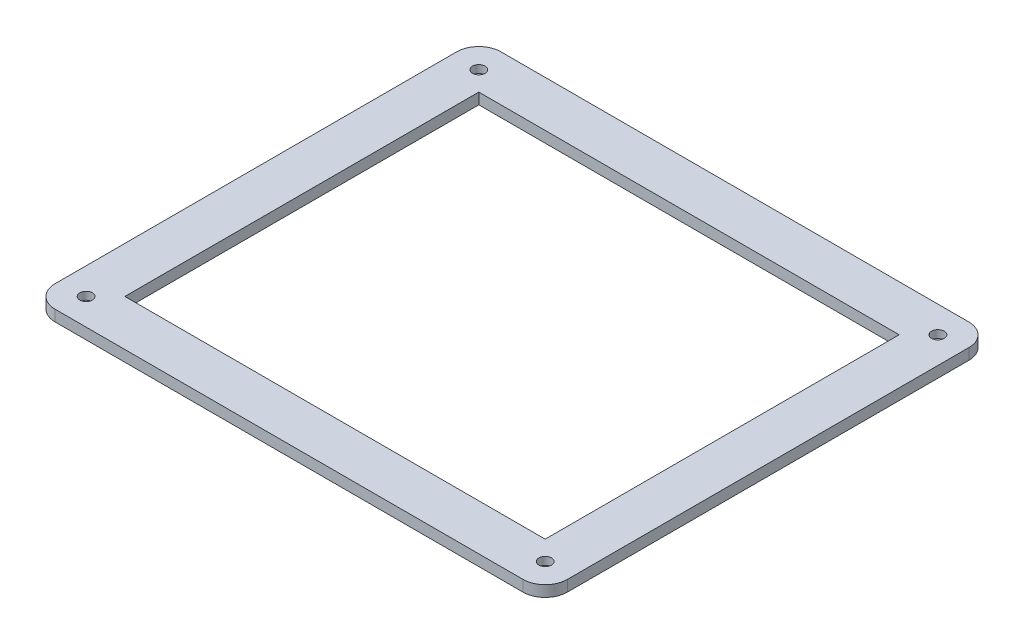
ISO-10303-21;
HEADER;
FILE_DESCRIPTION(('STEP AP214'),'2;1');
FILE_NAME('part.step','',(''),(''),'','','');
FILE_SCHEMA(('AUTOMOTIVE_DESIGN { 1 0 10303 214 1 1 1 1 }'));
ENDSEC;
DATA;
#1=APPLICATION_CONTEXT('core data for automotive mechanical design processes');
#2=APPLICATION_PROTOCOL_DEFINITION('international standard','automotive_design',2000,#1);
#3=PRODUCT_CONTEXT('',#1,'mechanical');
#4=PRODUCT('Part','Part','',(#3));
#5=PRODUCT_RELATED_PRODUCT_CATEGORY('part','',(#4));
#6=PRODUCT_DEFINITION_FORMATION('','',#4);
#7=PRODUCT_DEFINITION_CONTEXT('part definition',#1,'design');
#8=PRODUCT_DEFINITION('design','',#6,#7);
#9=PRODUCT_DEFINITION_SHAPE('','',#8);
#10=(LENGTH_UNIT() NAMED_UNIT(*) SI_UNIT(.MILLI.,.METRE.));
#11=(NAMED_UNIT(*) PLANE_ANGLE_UNIT() SI_UNIT($,.RADIAN.));
#12=(NAMED_UNIT(*) SI_UNIT($,.STERADIAN.) SOLID_ANGLE_UNIT());
#13=UNCERTAINTY_MEASURE_WITH_UNIT(LENGTH_MEASURE(1.E-05),#10,'distance_accuracy_value','');
#14=(GEOMETRIC_REPRESENTATION_CONTEXT(3) GLOBAL_UNCERTAINTY_ASSIGNED_CONTEXT((#13)) GLOBAL_UNIT_ASSIGNED_CONTEXT((#10,
#11,#12)) REPRESENTATION_CONTEXT('',''));
#15=CARTESIAN_POINT('',(0.,0.,0.));
#16=DIRECTION('',(0.,0.,1.));
#17=DIRECTION('',(1.,0.,0.));
#18=AXIS2_PLACEMENT_3D('',#15,#16,#17);
#19=CARTESIAN_POINT('',(-103.7,-2.5,-88.7));
#20=DIRECTION('',(0.,1.,0.));
#21=DIRECTION('',(0.,0.,1.));
#22=AXIS2_PLACEMENT_3D('',#19,#20,#21);
#23=CYLINDRICAL_SURFACE('',#22,1.54999999999999);
#24=CARTESIAN_POINT('',(-103.7,-2.5,-88.7));
#25=DIRECTION('',(0.,-1.,0.));
#26=DIRECTION('',(0.,0.,-1.));
#27=AXIS2_PLACEMENT_3D('',#24,#25,#26);
#28=CIRCLE('',#27,1.54999999999999);
#29=CARTESIAN_POINT('',(-103.7,-2.5,-90.25));
#30=VERTEX_POINT('',#29);
#31=EDGE_CURVE('E656',#30,#30,#28,.T.);
#32=ORIENTED_EDGE('',*,*,#31,.T.);
#33=EDGE_LOOP('',(#32));
#34=FACE_BOUND('',#33,.T.);
#35=CARTESIAN_POINT('',(-103.7,1.5,-88.7));
#36=DIRECTION('',(0.,1.,0.));
#37=DIRECTION('',(0.,0.,1.));
#38=AXIS2_PLACEMENT_3D('',#35,#36,#37);
#39=CIRCLE('',#38,1.54999999999999);
#40=CARTESIAN_POINT('',(-103.7,1.5,-87.15));
#41=VERTEX_POINT('',#40);
#42=EDGE_CURVE('E40',#41,#41,#39,.T.);
#43=ORIENTED_EDGE('',*,*,#42,.T.);
#44=EDGE_LOOP('',(#43));
#45=FACE_BOUND('',#44,.T.);
#46=ADVANCED_FACE('F36',(#34,#45),#23,.F.);
#47=CARTESIAN_POINT('',(103.7,-2.5,-88.7));
#48=DIRECTION('',(0.,1.,0.));
#49=DIRECTION('',(0.,0.,1.));
#50=AXIS2_PLACEMENT_3D('',#47,#48,#49);
#51=CYLINDRICAL_SURFACE('',#50,1.54999999999999);
#52=CARTESIAN_POINT('',(103.7,-2.5,-88.7));
#53=DIRECTION('',(0.,1.,0.));
#54=DIRECTION('',(0.,0.,-1.));
#55=AXIS2_PLACEMENT_3D('',#52,#53,#54);
#56=CIRCLE('',#55,1.54999999999999);
#57=CARTESIAN_POINT('',(103.7,-2.5,-90.25));
#58=VERTEX_POINT('',#57);
#59=EDGE_CURVE('E241',#58,#58,#56,.T.);
#60=ORIENTED_EDGE('',*,*,#59,.F.);
#61=EDGE_LOOP('',(#60));
#62=FACE_BOUND('',#61,.T.);
#63=CARTESIAN_POINT('',(103.7,1.5,-88.7));
#64=DIRECTION('',(0.,1.,0.));
#65=DIRECTION('',(0.,0.,1.));
#66=AXIS2_PLACEMENT_3D('',#63,#64,#65);
#67=CIRCLE('',#66,1.54999999999999);
#68=CARTESIAN_POINT('',(103.7,1.5,-87.15));
#69=VERTEX_POINT('',#68);
#70=EDGE_CURVE('E239',#69,#69,#67,.F.);
#71=ORIENTED_EDGE('',*,*,#70,.F.);
#72=EDGE_LOOP('',(#71));
#73=FACE_BOUND('',#72,.T.);
#74=ADVANCED_FACE('F316',(#62,#73),#51,.F.);
#75=CARTESIAN_POINT('',(103.7,-2.5,88.7));
#76=DIRECTION('',(0.,1.,0.));
#77=DIRECTION('',(0.,0.,1.));
#78=AXIS2_PLACEMENT_3D('',#75,#76,#77);
#79=CYLINDRICAL_SURFACE('',#78,1.54999999999999);
#80=CARTESIAN_POINT('',(103.7,-2.5,88.7));
#81=DIRECTION('',(0.,-1.,0.));
#82=DIRECTION('',(0.,0.,1.));
#83=AXIS2_PLACEMENT_3D('',#80,#81,#82);
#84=CIRCLE('',#83,1.54999999999999);
#85=CARTESIAN_POINT('',(103.7,-2.5,90.25));
#86=VERTEX_POINT('',#85);
#87=EDGE_CURVE('E237',#86,#86,#84,.T.);
#88=ORIENTED_EDGE('',*,*,#87,.T.);
#89=EDGE_LOOP('',(#88));
#90=FACE_BOUND('',#89,.T.);
#91=CARTESIAN_POINT('',(103.7,1.5,88.7));
#92=DIRECTION('',(0.,1.,0.));
#93=DIRECTION('',(0.,0.,1.));
#94=AXIS2_PLACEMENT_3D('',#91,#92,#93);
#95=CIRCLE('',#94,1.54999999999999);
#96=CARTESIAN_POINT('',(103.7,1.5,90.25));
#97=VERTEX_POINT('',#96);
#98=EDGE_CURVE('E235',#97,#97,#95,.T.);
#99=ORIENTED_EDGE('',*,*,#98,.T.);
#100=EDGE_LOOP('',(#99));
#101=FACE_BOUND('',#100,.T.);
#102=ADVANCED_FACE('F322',(#90,#101),#79,.F.);
#103=CARTESIAN_POINT('',(-103.7,-2.5,88.7));
#104=DIRECTION('',(0.,1.,0.));
#105=DIRECTION('',(0.,0.,1.));
#106=AXIS2_PLACEMENT_3D('',#103,#104,#105);
#107=CYLINDRICAL_SURFACE('',#106,1.54999999999999);
#108=CARTESIAN_POINT('',(-103.7,-2.5,88.7));
#109=DIRECTION('',(0.,1.,0.));
#110=DIRECTION('',(0.,0.,1.));
#111=AXIS2_PLACEMENT_3D('',#108,#109,#110);
#112=CIRCLE('',#111,1.54999999999999);
#113=CARTESIAN_POINT('',(-103.7,-2.5,90.25));
#114=VERTEX_POINT('',#113);
#115=EDGE_CURVE('E233',#114,#114,#112,.T.);
#116=ORIENTED_EDGE('',*,*,#115,.F.);
#117=EDGE_LOOP('',(#116));
#118=FACE_BOUND('',#117,.T.);
#119=CARTESIAN_POINT('',(-103.7,1.5,88.7));
#120=DIRECTION('',(0.,1.,0.));
#121=DIRECTION('',(0.,0.,1.));
#122=AXIS2_PLACEMENT_3D('',#119,#120,#121);
#123=CIRCLE('',#122,1.54999999999999);
#124=CARTESIAN_POINT('',(-103.7,1.5,90.25));
#125=VERTEX_POINT('',#124);
#126=EDGE_CURVE('E230',#125,#125,#123,.F.);
#127=ORIENTED_EDGE('',*,*,#126,.F.);
#128=EDGE_LOOP('',(#127));
#129=FACE_BOUND('',#128,.T.);
#130=ADVANCED_FACE('F365',(#118,#129),#107,.F.);
#131=CARTESIAN_POINT('',(0.,5.,0.));
#132=DIRECTION('',(0.,1.,0.));
#133=DIRECTION('',(0.,0.,1.));
#134=AXIS2_PLACEMENT_3D('',#131,#132,#133);
#135=PLANE('',#134);
#136=CARTESIAN_POINT('',(-103.7,5.,-88.7));
#137=DIRECTION('',(0.,-1.,0.));
#138=DIRECTION('',(0.,0.,-1.));
#139=AXIS2_PLACEMENT_3D('',#136,#137,#138);
#140=CIRCLE('',#139,2.85);
#141=CARTESIAN_POINT('',(-103.7,5.,-91.55));
#142=VERTEX_POINT('',#141);
#143=EDGE_CURVE('E625',#142,#142,#140,.T.);
#144=ORIENTED_EDGE('',*,*,#143,.T.);
#145=EDGE_LOOP('',(#144));
#146=FACE_BOUND('',#145,.T.);
#147=CARTESIAN_POINT('',(103.7,5.,-88.7));
#148=DIRECTION('',(0.,1.,0.));
#149=DIRECTION('',(0.,0.,-1.));
#150=AXIS2_PLACEMENT_3D('',#147,#148,#149);
#151=CIRCLE('',#150,2.85);
#152=CARTESIAN_POINT('',(103.7,5.,-91.55));
#153=VERTEX_POINT('',#152);
#154=EDGE_CURVE('E249',#153,#153,#151,.T.);
#155=ORIENTED_EDGE('',*,*,#154,.F.);
#156=EDGE_LOOP('',(#155));
#157=FACE_BOUND('',#156,.T.);
#158=CARTESIAN_POINT('',(103.7,5.,88.7));
#159=DIRECTION('',(0.,-1.,0.));
#160=DIRECTION('',(0.,0.,1.));
#161=AXIS2_PLACEMENT_3D('',#158,#159,#160);
#162=CIRCLE('',#161,2.85);
#163=CARTESIAN_POINT('',(103.7,5.,91.55));
#164=VERTEX_POINT('',#163);
#165=EDGE_CURVE('E262',#164,#164,#162,.T.);
#166=ORIENTED_EDGE('',*,*,#165,.T.);
#167=EDGE_LOOP('',(#166));
#168=FACE_BOUND('',#167,.T.);
#169=CARTESIAN_POINT('',(-103.7,5.,88.7));
#170=DIRECTION('',(0.,1.,0.));
#171=DIRECTION('',(0.,0.,1.));
#172=AXIS2_PLACEMENT_3D('',#169,#170,#171);
#173=CIRCLE('',#172,2.85);
#174=CARTESIAN_POINT('',(-103.7,5.,91.55));
#175=VERTEX_POINT('',#174);
#176=EDGE_CURVE('E273',#175,#175,#173,.T.);
#177=ORIENTED_EDGE('',*,*,#176,.F.);
#178=EDGE_LOOP('',(#177));
#179=FACE_BOUND('',#178,.T.);
#180=DIRECTION('',(-1.,0.,0.));
#181=VECTOR('',#180,1.);
#182=CARTESIAN_POINT('',(-115.7,5.,-100.7));
#183=LINE('',#182,#181);
#184=CARTESIAN_POINT('',(105.7,5.,-100.7));
#185=VERTEX_POINT('',#184);
#186=CARTESIAN_POINT('',(-105.7,5.,-100.7));
#187=VERTEX_POINT('',#186);
#188=EDGE_CURVE('E182',#185,#187,#183,.T.);
#189=ORIENTED_EDGE('',*,*,#188,.T.);
#190=CARTESIAN_POINT('',(-105.7,5.,-90.7));
#191=DIRECTION('',(0.,1.,0.));
#192=DIRECTION('',(0.,0.,1.));
#193=AXIS2_PLACEMENT_3D('',#190,#191,#192);
#194=CIRCLE('',#193,10.);
#195=CARTESIAN_POINT('',(-115.7,5.,-90.7));
#196=VERTEX_POINT('',#195);
#197=EDGE_CURVE('E217',#187,#196,#194,.T.);
#198=ORIENTED_EDGE('',*,*,#197,.T.);
#199=DIRECTION('',(0.,0.,1.));
#200=VECTOR('',#199,1.);
#201=CARTESIAN_POINT('',(-115.7,5.,-100.7));
#202=LINE('',#201,#200);
#203=CARTESIAN_POINT('',(-115.7,5.,90.7));
#204=VERTEX_POINT('',#203);
#205=EDGE_CURVE('E174',#196,#204,#202,.T.);
#206=ORIENTED_EDGE('',*,*,#205,.T.);
#207=CARTESIAN_POINT('',(-105.7,5.,90.7));
#208=DIRECTION('',(0.,1.,0.));
#209=DIRECTION('',(0.,0.,1.));
#210=AXIS2_PLACEMENT_3D('',#207,#208,#209);
#211=CIRCLE('',#210,10.);
#212=CARTESIAN_POINT('',(-105.7,5.,100.7));
#213=VERTEX_POINT('',#212);
#214=EDGE_CURVE('E212',#204,#213,#211,.T.);
#215=ORIENTED_EDGE('',*,*,#214,.T.);
#216=DIRECTION('',(1.,0.,0.));
#217=VECTOR('',#216,1.);
#218=CARTESIAN_POINT('',(-115.7,5.,100.7));
#219=LINE('',#218,#217);
#220=CARTESIAN_POINT('',(105.7,5.,100.7));
#221=VERTEX_POINT('',#220);
#222=EDGE_CURVE('E177',#213,#221,#219,.T.);
#223=ORIENTED_EDGE('',*,*,#222,.T.);
#224=CARTESIAN_POINT('',(105.7,5.,90.7));
#225=DIRECTION('',(0.,1.,0.));
#226=DIRECTION('',(0.,0.,1.));
#227=AXIS2_PLACEMENT_3D('',#224,#225,#226);
#228=CIRCLE('',#227,10.);
#229=CARTESIAN_POINT('',(115.7,5.,90.7));
#230=VERTEX_POINT('',#229);
#231=EDGE_CURVE('E60',#221,#230,#228,.T.);
#232=ORIENTED_EDGE('',*,*,#231,.T.);
#233=DIRECTION('',(0.,0.,-1.));
#234=VECTOR('',#233,1.);
#235=CARTESIAN_POINT('',(115.7,5.,-100.7));
#236=LINE('',#235,#234);
#237=CARTESIAN_POINT('',(115.7,5.,-90.7));
#238=VERTEX_POINT('',#237);
#239=EDGE_CURVE('E180',#230,#238,#236,.T.);
#240=ORIENTED_EDGE('',*,*,#239,.T.);
#241=CARTESIAN_POINT('',(105.7,5.,-90.7));
#242=DIRECTION('',(0.,1.,0.));
#243=DIRECTION('',(0.,0.,1.));
#244=AXIS2_PLACEMENT_3D('',#241,#242,#243);
#245=CIRCLE('',#244,10.);
#246=EDGE_CURVE('E215',#238,#185,#245,.T.);
#247=ORIENTED_EDGE('',*,*,#246,.T.);
#248=EDGE_LOOP('',(#189,#198,#206,#215,#223,#232,#240,#247));
#249=FACE_BOUND('',#248,.T.);
#250=DIRECTION('',(1.,0.,0.));
#251=VECTOR('',#250,1.);
#252=CARTESIAN_POINT('',(-94.95,5.,79.95));
#253=LINE('',#252,#251);
#254=CARTESIAN_POINT('',(-94.95,5.,79.95));
#255=VERTEX_POINT('',#254);
#256=CARTESIAN_POINT('',(94.95,5.,79.95));
#257=VERTEX_POINT('',#256);
#258=EDGE_CURVE('E140',#255,#257,#253,.T.);
#259=ORIENTED_EDGE('',*,*,#258,.F.);
#260=DIRECTION('',(0.,0.,1.));
#261=VECTOR('',#260,1.);
#262=CARTESIAN_POINT('',(-94.95,5.,-79.95));
#263=LINE('',#262,#261);
#264=CARTESIAN_POINT('',(-94.95,5.,-79.95));
#265=VERTEX_POINT('',#264);
#266=EDGE_CURVE('E130',#265,#255,#263,.T.);
#267=ORIENTED_EDGE('',*,*,#266,.F.);
#268=DIRECTION('',(-1.,0.,0.));
#269=VECTOR('',#268,1.);
#270=CARTESIAN_POINT('',(-94.95,5.,-79.95));
#271=LINE('',#270,#269);
#272=CARTESIAN_POINT('',(94.95,5.,-79.95));
#273=VERTEX_POINT('',#272);
#274=EDGE_CURVE('E156',#273,#265,#271,.T.);
#275=ORIENTED_EDGE('',*,*,#274,.F.);
#276=DIRECTION('',(0.,0.,-1.));
#277=VECTOR('',#276,1.);
#278=CARTESIAN_POINT('',(94.95,5.,-79.95));
#279=LINE('',#278,#277);
#280=EDGE_CURVE('E154',#257,#273,#279,.T.);
#281=ORIENTED_EDGE('',*,*,#280,.F.);
#282=EDGE_LOOP('',(#259,#267,#275,#281));
#283=FACE_BOUND('',#282,.T.);
#284=ADVANCED_FACE('F152',(#146,#157,#168,#179,#249,#283),#135,.T.);
#285=CARTESIAN_POINT('',(0.,0.,0.));
#286=DIRECTION('',(0.,1.,0.));
#287=DIRECTION('',(0.,0.,1.));
#288=AXIS2_PLACEMENT_3D('',#285,#286,#287);
#289=PLANE('',#288);
#290=CARTESIAN_POINT('',(-103.7,0.,-88.7));
#291=DIRECTION('',(0.,1.,0.));
#292=DIRECTION('',(0.,0.,1.));
#293=AXIS2_PLACEMENT_3D('',#290,#291,#292);
#294=CIRCLE('',#293,5.85);
#295=CARTESIAN_POINT('',(-103.7,0.,-82.85));
#296=VERTEX_POINT('',#295);
#297=EDGE_CURVE('E257',#296,#296,#294,.T.);
#298=ORIENTED_EDGE('',*,*,#297,.T.);
#299=EDGE_LOOP('',(#298));
#300=FACE_BOUND('',#299,.T.);
#301=CARTESIAN_POINT('',(103.7,0.,-88.7));
#302=DIRECTION('',(0.,1.,0.));
#303=DIRECTION('',(0.,0.,1.));
#304=AXIS2_PLACEMENT_3D('',#301,#302,#303);
#305=CIRCLE('',#304,5.85);
#306=CARTESIAN_POINT('',(103.7,0.,-82.85));
#307=VERTEX_POINT('',#306);
#308=EDGE_CURVE('E11',#307,#307,#305,.F.);
#309=ORIENTED_EDGE('',*,*,#308,.F.);
#310=EDGE_LOOP('',(#309));
#311=FACE_BOUND('',#310,.T.);
#312=CARTESIAN_POINT('',(103.7,0.,88.7));
#313=DIRECTION('',(0.,1.,0.));
#314=DIRECTION('',(0.,0.,-1.));
#315=AXIS2_PLACEMENT_3D('',#312,#313,#314);
#316=CIRCLE('',#315,5.85);
#317=CARTESIAN_POINT('',(103.7,0.,82.85));
#318=VERTEX_POINT('',#317);
#319=EDGE_CURVE('E269',#318,#318,#316,.T.);
#320=ORIENTED_EDGE('',*,*,#319,.T.);
#321=EDGE_LOOP('',(#320));
#322=FACE_BOUND('',#321,.T.);
#323=CARTESIAN_POINT('',(-103.7,0.,88.7));
#324=DIRECTION('',(0.,1.,0.));
#325=DIRECTION('',(0.,0.,1.));
#326=AXIS2_PLACEMENT_3D('',#323,#324,#325);
#327=CIRCLE('',#326,5.85);
#328=CARTESIAN_POINT('',(-103.7,0.,94.55));
#329=VERTEX_POINT('',#328);
#330=EDGE_CURVE('E45',#329,#329,#327,.F.);
#331=ORIENTED_EDGE('',*,*,#330,.F.);
#332=EDGE_LOOP('',(#331));
#333=FACE_BOUND('',#332,.T.);
#334=DIRECTION('',(0.,0.,1.));
#335=VECTOR('',#334,1.);
#336=CARTESIAN_POINT('',(-115.7,0.,-100.7));
#337=LINE('',#336,#335);
#338=CARTESIAN_POINT('',(-115.7,0.,-90.7));
#339=VERTEX_POINT('',#338);
#340=CARTESIAN_POINT('',(-115.7,0.,90.7));
#341=VERTEX_POINT('',#340);
#342=EDGE_CURVE('E148',#339,#341,#337,.T.);
#343=ORIENTED_EDGE('',*,*,#342,.F.);
#344=CARTESIAN_POINT('',(-105.7,0.,-90.7));
#345=DIRECTION('',(0.,1.,0.));
#346=DIRECTION('',(0.,0.,1.));
#347=AXIS2_PLACEMENT_3D('',#344,#345,#346);
#348=CIRCLE('',#347,10.);
#349=CARTESIAN_POINT('',(-105.7,0.,-100.7));
#350=VERTEX_POINT('',#349);
#351=EDGE_CURVE('E205',#339,#350,#348,.F.);
#352=ORIENTED_EDGE('',*,*,#351,.T.);
#353=DIRECTION('',(-1.,0.,0.));
#354=VECTOR('',#353,1.);
#355=CARTESIAN_POINT('',(-115.7,0.,-100.7));
#356=LINE('',#355,#354);
#357=CARTESIAN_POINT('',(105.7,0.,-100.7));
#358=VERTEX_POINT('',#357);
#359=EDGE_CURVE('E178',#358,#350,#356,.T.);
#360=ORIENTED_EDGE('',*,*,#359,.F.);
#361=CARTESIAN_POINT('',(105.7,0.,-90.7));
#362=DIRECTION('',(0.,1.,0.));
#363=DIRECTION('',(0.,0.,1.));
#364=AXIS2_PLACEMENT_3D('',#361,#362,#363);
#365=CIRCLE('',#364,10.);
#366=CARTESIAN_POINT('',(115.7,0.,-90.7));
#367=VERTEX_POINT('',#366);
#368=EDGE_CURVE('E203',#358,#367,#365,.F.);
#369=ORIENTED_EDGE('',*,*,#368,.T.);
#370=DIRECTION('',(0.,0.,-1.));
#371=VECTOR('',#370,1.);
#372=CARTESIAN_POINT('',(115.7,0.,-100.7));
#373=LINE('',#372,#371);
#374=CARTESIAN_POINT('',(115.7,0.,90.7));
#375=VERTEX_POINT('',#374);
#376=EDGE_CURVE('E191',#375,#367,#373,.T.);
#377=ORIENTED_EDGE('',*,*,#376,.F.);
#378=CARTESIAN_POINT('',(105.7,0.,90.7));
#379=DIRECTION('',(0.,1.,0.));
#380=DIRECTION('',(0.,0.,1.));
#381=AXIS2_PLACEMENT_3D('',#378,#379,#380);
#382=CIRCLE('',#381,10.);
#383=CARTESIAN_POINT('',(105.7,0.,100.7));
#384=VERTEX_POINT('',#383);
#385=EDGE_CURVE('E201',#375,#384,#382,.F.);
#386=ORIENTED_EDGE('',*,*,#385,.T.);
#387=DIRECTION('',(1.,0.,0.));
#388=VECTOR('',#387,1.);
#389=CARTESIAN_POINT('',(-115.7,0.,100.7));
#390=LINE('',#389,#388);
#391=CARTESIAN_POINT('',(-105.7,0.,100.7));
#392=VERTEX_POINT('',#391);
#393=EDGE_CURVE('E188',#392,#384,#390,.T.);
#394=ORIENTED_EDGE('',*,*,#393,.F.);
#395=CARTESIAN_POINT('',(-105.7,0.,90.7));
#396=DIRECTION('',(0.,1.,0.));
#397=DIRECTION('',(0.,0.,1.));
#398=AXIS2_PLACEMENT_3D('',#395,#396,#397);
#399=CIRCLE('',#398,10.);
#400=EDGE_CURVE('E199',#392,#341,#399,.F.);
#401=ORIENTED_EDGE('',*,*,#400,.T.);
#402=EDGE_LOOP('',(#343,#352,#360,#369,#377,#386,#394,#401));
#403=FACE_BOUND('',#402,.T.);
#404=DIRECTION('',(0.,0.,1.));
#405=VECTOR('',#404,1.);
#406=CARTESIAN_POINT('',(-94.95,0.,-79.95));
#407=LINE('',#406,#405);
#408=CARTESIAN_POINT('',(-94.95,0.,-79.95));
#409=VERTEX_POINT('',#408);
#410=CARTESIAN_POINT('',(-94.95,0.,79.95));
#411=VERTEX_POINT('',#410);
#412=EDGE_CURVE('E161',#409,#411,#407,.T.);
#413=ORIENTED_EDGE('',*,*,#412,.T.);
#414=DIRECTION('',(1.,0.,0.));
#415=VECTOR('',#414,1.);
#416=CARTESIAN_POINT('',(-94.95,0.,79.95));
#417=LINE('',#416,#415);
#418=CARTESIAN_POINT('',(94.95,0.,79.95));
#419=VERTEX_POINT('',#418);
#420=EDGE_CURVE('E147',#411,#419,#417,.T.);
#421=ORIENTED_EDGE('',*,*,#420,.T.);
#422=DIRECTION('',(0.,0.,-1.));
#423=VECTOR('',#422,1.);
#424=CARTESIAN_POINT('',(94.95,0.,-79.95));
#425=LINE('',#424,#423);
#426=CARTESIAN_POINT('',(94.95,0.,-79.95));
#427=VERTEX_POINT('',#426);
#428=EDGE_CURVE('E165',#419,#427,#425,.T.);
#429=ORIENTED_EDGE('',*,*,#428,.T.);
#430=DIRECTION('',(-1.,0.,0.));
#431=VECTOR('',#430,1.);
#432=CARTESIAN_POINT('',(-94.95,0.,-79.95));
#433=LINE('',#432,#431);
#434=EDGE_CURVE('E141',#427,#409,#433,.T.);
#435=ORIENTED_EDGE('',*,*,#434,.T.);
#436=EDGE_LOOP('',(#413,#421,#429,#435));
#437=FACE_BOUND('',#436,.T.);
#438=ADVANCED_FACE('F292',(#300,#311,#322,#333,#403,#437),#289,.F.);
#439=CARTESIAN_POINT('',(-115.7,5.,-100.7));
#440=DIRECTION('',(1.,0.,0.));
#441=DIRECTION('',(0.,0.,-1.));
#442=AXIS2_PLACEMENT_3D('',#439,#440,#441);
#443=PLANE('',#442);
#444=ORIENTED_EDGE('',*,*,#205,.F.);
#445=DIRECTION('',(0.,-1.,0.));
#446=VECTOR('',#445,1.);
#447=CARTESIAN_POINT('',(-115.7,5.,-90.7));
#448=LINE('',#447,#446);
#449=EDGE_CURVE('E196',#196,#339,#448,.T.);
#450=ORIENTED_EDGE('',*,*,#449,.T.);
#451=ORIENTED_EDGE('',*,*,#342,.T.);
#452=DIRECTION('',(0.,-1.,0.));
#453=VECTOR('',#452,1.);
#454=CARTESIAN_POINT('',(-115.7,5.,90.7));
#455=LINE('',#454,#453);
#456=EDGE_CURVE('E185',#341,#204,#455,.F.);
#457=ORIENTED_EDGE('',*,*,#456,.T.);
#458=EDGE_LOOP('',(#444,#450,#451,#457));
#459=FACE_BOUND('',#458,.T.);
#460=ADVANCED_FACE('F295',(#459),#443,.F.);
#461=CARTESIAN_POINT('',(-115.7,5.,100.7));
#462=DIRECTION('',(0.,0.,-1.));
#463=DIRECTION('',(-1.,0.,0.));
#464=AXIS2_PLACEMENT_3D('',#461,#462,#463);
#465=PLANE('',#464);
#466=ORIENTED_EDGE('',*,*,#393,.T.);
#467=DIRECTION('',(0.,-1.,0.));
#468=VECTOR('',#467,1.);
#469=CARTESIAN_POINT('',(105.7,5.,100.7));
#470=LINE('',#469,#468);
#471=EDGE_CURVE('E226',#384,#221,#470,.F.);
#472=ORIENTED_EDGE('',*,*,#471,.T.);
#473=ORIENTED_EDGE('',*,*,#222,.F.);
#474=DIRECTION('',(0.,-1.,0.));
#475=VECTOR('',#474,1.);
#476=CARTESIAN_POINT('',(-105.7,5.,100.7));
#477=LINE('',#476,#475);
#478=EDGE_CURVE('E223',#213,#392,#477,.T.);
#479=ORIENTED_EDGE('',*,*,#478,.T.);
#480=EDGE_LOOP('',(#466,#472,#473,#479));
#481=FACE_BOUND('',#480,.T.);
#482=ADVANCED_FACE('F583',(#481),#465,.F.);
#483=CARTESIAN_POINT('',(115.7,5.,-100.7));
#484=DIRECTION('',(-1.,0.,0.));
#485=DIRECTION('',(0.,0.,1.));
#486=AXIS2_PLACEMENT_3D('',#483,#484,#485);
#487=PLANE('',#486);
#488=ORIENTED_EDGE('',*,*,#376,.T.);
#489=DIRECTION('',(0.,-1.,0.));
#490=VECTOR('',#489,1.);
#491=CARTESIAN_POINT('',(115.7,5.,-90.7));
#492=LINE('',#491,#490);
#493=EDGE_CURVE('E53',#367,#238,#492,.F.);
#494=ORIENTED_EDGE('',*,*,#493,.T.);
#495=ORIENTED_EDGE('',*,*,#239,.F.);
#496=DIRECTION('',(0.,-1.,0.));
#497=VECTOR('',#496,1.);
#498=CARTESIAN_POINT('',(115.7,5.,90.7));
#499=LINE('',#498,#497);
#500=EDGE_CURVE('E219',#230,#375,#499,.T.);
#501=ORIENTED_EDGE('',*,*,#500,.T.);
#502=EDGE_LOOP('',(#488,#494,#495,#501));
#503=FACE_BOUND('',#502,.T.);
#504=ADVANCED_FACE('F574',(#503),#487,.F.);
#505=CARTESIAN_POINT('',(-115.7,5.,-100.7));
#506=DIRECTION('',(0.,0.,1.));
#507=DIRECTION('',(1.,0.,0.));
#508=AXIS2_PLACEMENT_3D('',#505,#506,#507);
#509=PLANE('',#508);
#510=ORIENTED_EDGE('',*,*,#359,.T.);
#511=DIRECTION('',(0.,-1.,0.));
#512=VECTOR('',#511,1.);
#513=CARTESIAN_POINT('',(-105.7,5.,-100.7));
#514=LINE('',#513,#512);
#515=EDGE_CURVE('E210',#350,#187,#514,.F.);
#516=ORIENTED_EDGE('',*,*,#515,.T.);
#517=ORIENTED_EDGE('',*,*,#188,.F.);
#518=DIRECTION('',(0.,-1.,0.));
#519=VECTOR('',#518,1.);
#520=CARTESIAN_POINT('',(105.7,5.,-100.7));
#521=LINE('',#520,#519);
#522=EDGE_CURVE('E207',#185,#358,#521,.T.);
#523=ORIENTED_EDGE('',*,*,#522,.T.);
#524=EDGE_LOOP('',(#510,#516,#517,#523));
#525=FACE_BOUND('',#524,.T.);
#526=ADVANCED_FACE('F567',(#525),#509,.F.);
#527=CARTESIAN_POINT('',(-94.95,5.,-79.95));
#528=DIRECTION('',(1.,0.,0.));
#529=DIRECTION('',(0.,0.,-1.));
#530=AXIS2_PLACEMENT_3D('',#527,#528,#529);
#531=PLANE('',#530);
#532=ORIENTED_EDGE('',*,*,#412,.F.);
#533=DIRECTION('',(0.,-1.,0.));
#534=VECTOR('',#533,1.);
#535=CARTESIAN_POINT('',(-94.95,5.,-79.95));
#536=LINE('',#535,#534);
#537=EDGE_CURVE('E136',#265,#409,#536,.T.);
#538=ORIENTED_EDGE('',*,*,#537,.F.);
#539=ORIENTED_EDGE('',*,*,#266,.T.);
#540=DIRECTION('',(0.,-1.,0.));
#541=VECTOR('',#540,1.);
#542=CARTESIAN_POINT('',(-94.95,5.,79.95));
#543=LINE('',#542,#541);
#544=EDGE_CURVE('E133',#255,#411,#543,.T.);
#545=ORIENTED_EDGE('',*,*,#544,.T.);
#546=EDGE_LOOP('',(#532,#538,#539,#545));
#547=FACE_BOUND('',#546,.T.);
#548=ADVANCED_FACE('F132',(#547),#531,.T.);
#549=CARTESIAN_POINT('',(-94.95,5.,79.95));
#550=DIRECTION('',(0.,0.,-1.));
#551=DIRECTION('',(-1.,0.,0.));
#552=AXIS2_PLACEMENT_3D('',#549,#550,#551);
#553=PLANE('',#552);
#554=ORIENTED_EDGE('',*,*,#420,.F.);
#555=ORIENTED_EDGE('',*,*,#544,.F.);
#556=ORIENTED_EDGE('',*,*,#258,.T.);
#557=DIRECTION('',(0.,-1.,0.));
#558=VECTOR('',#557,1.);
#559=CARTESIAN_POINT('',(94.95,5.,79.95));
#560=LINE('',#559,#558);
#561=EDGE_CURVE('E149',#257,#419,#560,.T.);
#562=ORIENTED_EDGE('',*,*,#561,.T.);
#563=EDGE_LOOP('',(#554,#555,#556,#562));
#564=FACE_BOUND('',#563,.T.);
#565=ADVANCED_FACE('F144',(#564),#553,.T.);
#566=CARTESIAN_POINT('',(94.95,5.,-79.95));
#567=DIRECTION('',(-1.,0.,0.));
#568=DIRECTION('',(0.,0.,1.));
#569=AXIS2_PLACEMENT_3D('',#566,#567,#568);
#570=PLANE('',#569);
#571=ORIENTED_EDGE('',*,*,#428,.F.);
#572=ORIENTED_EDGE('',*,*,#561,.F.);
#573=ORIENTED_EDGE('',*,*,#280,.T.);
#574=DIRECTION('',(0.,-1.,0.));
#575=VECTOR('',#574,1.);
#576=CARTESIAN_POINT('',(94.95,5.,-79.95));
#577=LINE('',#576,#575);
#578=EDGE_CURVE('E171',#273,#427,#577,.T.);
#579=ORIENTED_EDGE('',*,*,#578,.T.);
#580=EDGE_LOOP('',(#571,#572,#573,#579));
#581=FACE_BOUND('',#580,.T.);
#582=ADVANCED_FACE('F305',(#581),#570,.T.);
#583=CARTESIAN_POINT('',(-94.95,5.,-79.95));
#584=DIRECTION('',(0.,0.,1.));
#585=DIRECTION('',(1.,0.,0.));
#586=AXIS2_PLACEMENT_3D('',#583,#584,#585);
#587=PLANE('',#586);
#588=ORIENTED_EDGE('',*,*,#434,.F.);
#589=ORIENTED_EDGE('',*,*,#578,.F.);
#590=ORIENTED_EDGE('',*,*,#274,.T.);
#591=ORIENTED_EDGE('',*,*,#537,.T.);
#592=EDGE_LOOP('',(#588,#589,#590,#591));
#593=FACE_BOUND('',#592,.T.);
#594=ADVANCED_FACE('F302',(#593),#587,.T.);
#595=CARTESIAN_POINT('',(-105.7,5.,-90.7));
#596=DIRECTION('',(0.,-1.,0.));
#597=DIRECTION('',(0.,0.,-1.));
#598=AXIS2_PLACEMENT_3D('',#595,#596,#597);
#599=CYLINDRICAL_SURFACE('',#598,10.);
#600=ORIENTED_EDGE('',*,*,#197,.F.);
#601=ORIENTED_EDGE('',*,*,#515,.F.);
#602=ORIENTED_EDGE('',*,*,#351,.F.);
#603=ORIENTED_EDGE('',*,*,#449,.F.);
#604=EDGE_LOOP('',(#600,#601,#602,#603));
#605=FACE_BOUND('',#604,.T.);
#606=ADVANCED_FACE('F312',(#605),#599,.T.);
#607=CARTESIAN_POINT('',(105.7,5.,-90.7));
#608=DIRECTION('',(0.,-1.,0.));
#609=DIRECTION('',(0.,0.,-1.));
#610=AXIS2_PLACEMENT_3D('',#607,#608,#609);
#611=CYLINDRICAL_SURFACE('',#610,10.);
#612=ORIENTED_EDGE('',*,*,#246,.F.);
#613=ORIENTED_EDGE('',*,*,#493,.F.);
#614=ORIENTED_EDGE('',*,*,#368,.F.);
#615=ORIENTED_EDGE('',*,*,#522,.F.);
#616=EDGE_LOOP('',(#612,#613,#614,#615));
#617=FACE_BOUND('',#616,.T.);
#618=ADVANCED_FACE('F527',(#617),#611,.T.);
#619=CARTESIAN_POINT('',(105.7,5.,90.7));
#620=DIRECTION('',(0.,-1.,0.));
#621=DIRECTION('',(0.,0.,-1.));
#622=AXIS2_PLACEMENT_3D('',#619,#620,#621);
#623=CYLINDRICAL_SURFACE('',#622,10.);
#624=ORIENTED_EDGE('',*,*,#231,.F.);
#625=ORIENTED_EDGE('',*,*,#471,.F.);
#626=ORIENTED_EDGE('',*,*,#385,.F.);
#627=ORIENTED_EDGE('',*,*,#500,.F.);
#628=EDGE_LOOP('',(#624,#625,#626,#627));
#629=FACE_BOUND('',#628,.T.);
#630=ADVANCED_FACE('F519',(#629),#623,.T.);
#631=CARTESIAN_POINT('',(-105.7,5.,90.7));
#632=DIRECTION('',(0.,-1.,0.));
#633=DIRECTION('',(0.,0.,-1.));
#634=AXIS2_PLACEMENT_3D('',#631,#632,#633);
#635=CYLINDRICAL_SURFACE('',#634,10.);
#636=ORIENTED_EDGE('',*,*,#214,.F.);
#637=ORIENTED_EDGE('',*,*,#456,.F.);
#638=ORIENTED_EDGE('',*,*,#400,.F.);
#639=ORIENTED_EDGE('',*,*,#478,.F.);
#640=EDGE_LOOP('',(#636,#637,#638,#639));
#641=FACE_BOUND('',#640,.T.);
#642=ADVANCED_FACE('F38',(#641),#635,.T.);
#643=CARTESIAN_POINT('',(-103.7,-2.5,88.7));
#644=DIRECTION('',(0.,1.,0.));
#645=DIRECTION('',(0.,0.,1.));
#646=AXIS2_PLACEMENT_3D('',#643,#644,#645);
#647=CYLINDRICAL_SURFACE('',#646,5.85);
#648=CARTESIAN_POINT('',(-103.7,-2.5,88.7));
#649=DIRECTION('',(0.,-1.,0.));
#650=DIRECTION('',(0.,0.,-1.));
#651=AXIS2_PLACEMENT_3D('',#648,#649,#650);
#652=CIRCLE('',#651,5.85);
#653=CARTESIAN_POINT('',(-103.7,-2.5,82.85));
#654=VERTEX_POINT('',#653);
#655=EDGE_CURVE('E163',#654,#654,#652,.T.);
#656=ORIENTED_EDGE('',*,*,#655,.F.);
#657=EDGE_LOOP('',(#656));
#658=FACE_BOUND('',#657,.T.);
#659=ORIENTED_EDGE('',*,*,#330,.T.);
#660=EDGE_LOOP('',(#659));
#661=FACE_BOUND('',#660,.T.);
#662=ADVANCED_FACE('F286',(#658,#661),#647,.T.);
#663=CARTESIAN_POINT('',(-103.7,-2.5,88.7));
#664=DIRECTION('',(0.,-1.,0.));
#665=DIRECTION('',(0.,0.,-1.));
#666=AXIS2_PLACEMENT_3D('',#663,#664,#665);
#667=PLANE('',#666);
#668=ORIENTED_EDGE('',*,*,#115,.T.);
#669=EDGE_LOOP('',(#668));
#670=FACE_BOUND('',#669,.T.);
#671=ORIENTED_EDGE('',*,*,#655,.T.);
#672=EDGE_LOOP('',(#671));
#673=FACE_BOUND('',#672,.T.);
#674=ADVANCED_FACE('F284',(#670,#673),#667,.T.);
#675=CARTESIAN_POINT('',(-103.7,1.5,88.7));
#676=DIRECTION('',(0.,1.,0.));
#677=DIRECTION('',(0.,0.,1.));
#678=AXIS2_PLACEMENT_3D('',#675,#676,#677);
#679=PLANE('',#678);
#680=CARTESIAN_POINT('',(-103.7,1.5,88.7));
#681=DIRECTION('',(0.,1.,0.));
#682=DIRECTION('',(0.,0.,1.));
#683=AXIS2_PLACEMENT_3D('',#680,#681,#682);
#684=CIRCLE('',#683,2.85);
#685=CARTESIAN_POINT('',(-103.7,1.5,91.55));
#686=VERTEX_POINT('',#685);
#687=EDGE_CURVE('E234',#686,#686,#684,.T.);
#688=ORIENTED_EDGE('',*,*,#687,.T.);
#689=EDGE_LOOP('',(#688));
#690=FACE_BOUND('',#689,.T.);
#691=ORIENTED_EDGE('',*,*,#126,.T.);
#692=EDGE_LOOP('',(#691));
#693=FACE_BOUND('',#692,.T.);
#694=ADVANCED_FACE('F375',(#690,#693),#679,.T.);
#695=CARTESIAN_POINT('',(-103.7,1.5,88.7));
#696=DIRECTION('',(0.,1.,0.));
#697=DIRECTION('',(0.,0.,1.));
#698=AXIS2_PLACEMENT_3D('',#695,#696,#697);
#699=CYLINDRICAL_SURFACE('',#698,2.85);
#700=ORIENTED_EDGE('',*,*,#687,.F.);
#701=EDGE_LOOP('',(#700));
#702=FACE_BOUND('',#701,.T.);
#703=ORIENTED_EDGE('',*,*,#176,.T.);
#704=EDGE_LOOP('',(#703));
#705=FACE_BOUND('',#704,.T.);
#706=ADVANCED_FACE('F373',(#702,#705),#699,.F.);
#707=CARTESIAN_POINT('',(103.7,-2.5,88.7));
#708=DIRECTION('',(0.,1.,0.));
#709=DIRECTION('',(0.,0.,1.));
#710=AXIS2_PLACEMENT_3D('',#707,#708,#709);
#711=CYLINDRICAL_SURFACE('',#710,5.85);
#712=CARTESIAN_POINT('',(103.7,-2.5,88.7));
#713=DIRECTION('',(0.,1.,0.));
#714=DIRECTION('',(0.,0.,-1.));
#715=AXIS2_PLACEMENT_3D('',#712,#713,#714);
#716=CIRCLE('',#715,5.85);
#717=CARTESIAN_POINT('',(103.7,-2.5,82.85));
#718=VERTEX_POINT('',#717);
#719=EDGE_CURVE('E270',#718,#718,#716,.T.);
#720=ORIENTED_EDGE('',*,*,#719,.T.);
#721=EDGE_LOOP('',(#720));
#722=FACE_BOUND('',#721,.T.);
#723=ORIENTED_EDGE('',*,*,#319,.F.);
#724=EDGE_LOOP('',(#723));
#725=FACE_BOUND('',#724,.T.);
#726=ADVANCED_FACE('F369',(#722,#725),#711,.T.);
#727=CARTESIAN_POINT('',(103.7,-2.5,88.7));
#728=DIRECTION('',(0.,-1.,0.));
#729=DIRECTION('',(0.,0.,-1.));
#730=AXIS2_PLACEMENT_3D('',#727,#728,#729);
#731=PLANE('',#730);
#732=ORIENTED_EDGE('',*,*,#87,.F.);
#733=EDGE_LOOP('',(#732));
#734=FACE_BOUND('',#733,.T.);
#735=ORIENTED_EDGE('',*,*,#719,.F.);
#736=EDGE_LOOP('',(#735));
#737=FACE_BOUND('',#736,.T.);
#738=ADVANCED_FACE('F361',(#734,#737),#731,.T.);
#739=CARTESIAN_POINT('',(103.7,1.5,88.7));
#740=DIRECTION('',(0.,1.,0.));
#741=DIRECTION('',(0.,0.,1.));
#742=AXIS2_PLACEMENT_3D('',#739,#740,#741);
#743=CYLINDRICAL_SURFACE('',#742,2.85);
#744=CARTESIAN_POINT('',(103.7,1.5,88.7));
#745=DIRECTION('',(0.,-1.,0.));
#746=DIRECTION('',(0.,0.,1.));
#747=AXIS2_PLACEMENT_3D('',#744,#745,#746);
#748=CIRCLE('',#747,2.85);
#749=CARTESIAN_POINT('',(103.7,1.5,91.55));
#750=VERTEX_POINT('',#749);
#751=EDGE_CURVE('E238',#750,#750,#748,.T.);
#752=ORIENTED_EDGE('',*,*,#751,.T.);
#753=EDGE_LOOP('',(#752));
#754=FACE_BOUND('',#753,.T.);
#755=ORIENTED_EDGE('',*,*,#165,.F.);
#756=EDGE_LOOP('',(#755));
#757=FACE_BOUND('',#756,.T.);
#758=ADVANCED_FACE('F357',(#754,#757),#743,.F.);
#759=CARTESIAN_POINT('',(103.7,1.5,88.7));
#760=DIRECTION('',(0.,1.,0.));
#761=DIRECTION('',(0.,0.,1.));
#762=AXIS2_PLACEMENT_3D('',#759,#760,#761);
#763=PLANE('',#762);
#764=ORIENTED_EDGE('',*,*,#98,.F.);
#765=EDGE_LOOP('',(#764));
#766=FACE_BOUND('',#765,.T.);
#767=ORIENTED_EDGE('',*,*,#751,.F.);
#768=EDGE_LOOP('',(#767));
#769=FACE_BOUND('',#768,.T.);
#770=ADVANCED_FACE('F353',(#766,#769),#763,.T.);
#771=CARTESIAN_POINT('',(103.7,-2.5,-88.7));
#772=DIRECTION('',(0.,1.,0.));
#773=DIRECTION('',(0.,0.,1.));
#774=AXIS2_PLACEMENT_3D('',#771,#772,#773);
#775=CYLINDRICAL_SURFACE('',#774,5.85);
#776=CARTESIAN_POINT('',(103.7,-2.5,-88.7));
#777=DIRECTION('',(0.,-1.,0.));
#778=DIRECTION('',(0.,0.,1.));
#779=AXIS2_PLACEMENT_3D('',#776,#777,#778);
#780=CIRCLE('',#779,5.85);
#781=CARTESIAN_POINT('',(103.7,-2.5,-82.85));
#782=VERTEX_POINT('',#781);
#783=EDGE_CURVE('E246',#782,#782,#780,.T.);
#784=ORIENTED_EDGE('',*,*,#783,.F.);
#785=EDGE_LOOP('',(#784));
#786=FACE_BOUND('',#785,.T.);
#787=ORIENTED_EDGE('',*,*,#308,.T.);
#788=EDGE_LOOP('',(#787));
#789=FACE_BOUND('',#788,.T.);
#790=ADVANCED_FACE('F349',(#786,#789),#775,.T.);
#791=CARTESIAN_POINT('',(103.7,-2.5,-88.7));
#792=DIRECTION('',(0.,-1.,0.));
#793=DIRECTION('',(0.,0.,1.));
#794=AXIS2_PLACEMENT_3D('',#791,#792,#793);
#795=PLANE('',#794);
#796=ORIENTED_EDGE('',*,*,#59,.T.);
#797=EDGE_LOOP('',(#796));
#798=FACE_BOUND('',#797,.T.);
#799=ORIENTED_EDGE('',*,*,#783,.T.);
#800=EDGE_LOOP('',(#799));
#801=FACE_BOUND('',#800,.T.);
#802=ADVANCED_FACE('F343',(#798,#801),#795,.T.);
#803=CARTESIAN_POINT('',(103.7,1.5,-88.7));
#804=DIRECTION('',(0.,1.,0.));
#805=DIRECTION('',(0.,0.,-1.));
#806=AXIS2_PLACEMENT_3D('',#803,#804,#805);
#807=PLANE('',#806);
#808=CARTESIAN_POINT('',(103.7,1.5,-88.7));
#809=DIRECTION('',(0.,1.,0.));
#810=DIRECTION('',(0.,0.,-1.));
#811=AXIS2_PLACEMENT_3D('',#808,#809,#810);
#812=CIRCLE('',#811,2.85);
#813=CARTESIAN_POINT('',(103.7,1.5,-91.55));
#814=VERTEX_POINT('',#813);
#815=EDGE_CURVE('E242',#814,#814,#812,.T.);
#816=ORIENTED_EDGE('',*,*,#815,.T.);
#817=EDGE_LOOP('',(#816));
#818=FACE_BOUND('',#817,.T.);
#819=ORIENTED_EDGE('',*,*,#70,.T.);
#820=EDGE_LOOP('',(#819));
#821=FACE_BOUND('',#820,.T.);
#822=ADVANCED_FACE('F340',(#818,#821),#807,.T.);
#823=CARTESIAN_POINT('',(103.7,1.5,-88.7));
#824=DIRECTION('',(0.,1.,0.));
#825=DIRECTION('',(0.,0.,1.));
#826=AXIS2_PLACEMENT_3D('',#823,#824,#825);
#827=CYLINDRICAL_SURFACE('',#826,2.85);
#828=ORIENTED_EDGE('',*,*,#815,.F.);
#829=EDGE_LOOP('',(#828));
#830=FACE_BOUND('',#829,.T.);
#831=ORIENTED_EDGE('',*,*,#154,.T.);
#832=EDGE_LOOP('',(#831));
#833=FACE_BOUND('',#832,.T.);
#834=ADVANCED_FACE('F338',(#830,#833),#827,.F.);
#835=CARTESIAN_POINT('',(-103.7,-2.5,-88.7));
#836=DIRECTION('',(0.,1.,0.));
#837=DIRECTION('',(0.,0.,1.));
#838=AXIS2_PLACEMENT_3D('',#835,#836,#837);
#839=CYLINDRICAL_SURFACE('',#838,5.85);
#840=CARTESIAN_POINT('',(-103.7,-2.5,-88.7));
#841=DIRECTION('',(0.,1.,0.));
#842=DIRECTION('',(0.,0.,1.));
#843=AXIS2_PLACEMENT_3D('',#840,#841,#842);
#844=CIRCLE('',#843,5.85);
#845=CARTESIAN_POINT('',(-103.7,-2.5,-82.85));
#846=VERTEX_POINT('',#845);
#847=EDGE_CURVE('E254',#846,#846,#844,.T.);
#848=ORIENTED_EDGE('',*,*,#847,.T.);
#849=EDGE_LOOP('',(#848));
#850=FACE_BOUND('',#849,.T.);
#851=ORIENTED_EDGE('',*,*,#297,.F.);
#852=EDGE_LOOP('',(#851));
#853=FACE_BOUND('',#852,.T.);
#854=ADVANCED_FACE('F334',(#850,#853),#839,.T.);
#855=CARTESIAN_POINT('',(-103.7,-2.5,-88.7));
#856=DIRECTION('',(0.,-1.,0.));
#857=DIRECTION('',(0.,0.,1.));
#858=AXIS2_PLACEMENT_3D('',#855,#856,#857);
#859=PLANE('',#858);
#860=ORIENTED_EDGE('',*,*,#31,.F.);
#861=EDGE_LOOP('',(#860));
#862=FACE_BOUND('',#861,.T.);
#863=ORIENTED_EDGE('',*,*,#847,.F.);
#864=EDGE_LOOP('',(#863));
#865=FACE_BOUND('',#864,.T.);
#866=ADVANCED_FACE('F331',(#862,#865),#859,.T.);
#867=CARTESIAN_POINT('',(-103.7,1.5,-88.7));
#868=DIRECTION('',(0.,1.,0.));
#869=DIRECTION('',(0.,0.,1.));
#870=AXIS2_PLACEMENT_3D('',#867,#868,#869);
#871=CYLINDRICAL_SURFACE('',#870,2.85);
#872=CARTESIAN_POINT('',(-103.7,1.5,-88.7));
#873=DIRECTION('',(0.,-1.,0.));
#874=DIRECTION('',(0.,0.,-1.));
#875=AXIS2_PLACEMENT_3D('',#872,#873,#874);
#876=CIRCLE('',#875,2.85);
#877=CARTESIAN_POINT('',(-103.7,1.5,-91.55));
#878=VERTEX_POINT('',#877);
#879=EDGE_CURVE('E651',#878,#878,#876,.T.);
#880=ORIENTED_EDGE('',*,*,#879,.T.);
#881=EDGE_LOOP('',(#880));
#882=FACE_BOUND('',#881,.T.);
#883=ORIENTED_EDGE('',*,*,#143,.F.);
#884=EDGE_LOOP('',(#883));
#885=FACE_BOUND('',#884,.T.);
#886=ADVANCED_FACE('F329',(#882,#885),#871,.F.);
#887=CARTESIAN_POINT('',(-103.7,1.5,-88.7));
#888=DIRECTION('',(0.,1.,0.));
#889=DIRECTION('',(0.,0.,-1.));
#890=AXIS2_PLACEMENT_3D('',#887,#888,#889);
#891=PLANE('',#890);
#892=ORIENTED_EDGE('',*,*,#42,.F.);
#893=EDGE_LOOP('',(#892));
#894=FACE_BOUND('',#893,.T.);
#895=ORIENTED_EDGE('',*,*,#879,.F.);
#896=EDGE_LOOP('',(#895));
#897=FACE_BOUND('',#896,.T.);
#898=ADVANCED_FACE('F453',(#894,#897),#891,.T.);
#899=CLOSED_SHELL('',(#46,#74,#102,#130,#284,#438,#460,#482,#504,#526,#548,#565,#582,#594,#606,
#618,#630,#642,#662,#674,#694,#706,#726,#738,#758,#770,#790,#802,#822,#834,#854,#866,#886,#898));
#900=MANIFOLD_SOLID_BREP('B2',#899);
#901=ADVANCED_BREP_SHAPE_REPRESENTATION('',(#18,#900),#14);
#902=SHAPE_DEFINITION_REPRESENTATION(#9,#901);
ENDSEC;
END-ISO-10303-21;
